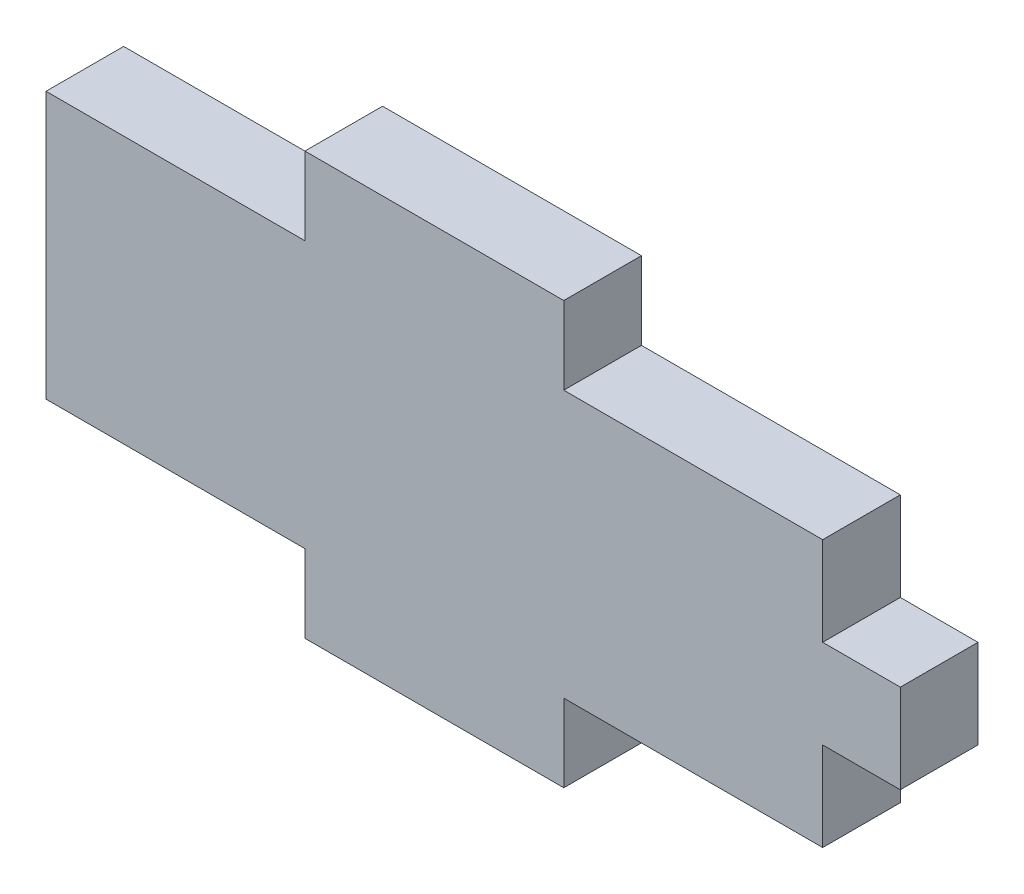
ISO-10303-21;
HEADER;
FILE_DESCRIPTION(('STEP AP214'),'2;1');
FILE_NAME('part.step','',(''),(''),'','','');
FILE_SCHEMA(('AUTOMOTIVE_DESIGN { 1 0 10303 214 1 1 1 1 }'));
ENDSEC;
DATA;
#1=APPLICATION_CONTEXT('core data for automotive mechanical design processes');
#2=APPLICATION_PROTOCOL_DEFINITION('international standard','automotive_design',2000,#1);
#3=PRODUCT_CONTEXT('',#1,'mechanical');
#4=PRODUCT('Part','Part','',(#3));
#5=PRODUCT_RELATED_PRODUCT_CATEGORY('part','',(#4));
#6=PRODUCT_DEFINITION_FORMATION('','',#4);
#7=PRODUCT_DEFINITION_CONTEXT('part definition',#1,'design');
#8=PRODUCT_DEFINITION('design','',#6,#7);
#9=PRODUCT_DEFINITION_SHAPE('','',#8);
#10=(LENGTH_UNIT() NAMED_UNIT(*) SI_UNIT(.MILLI.,.METRE.));
#11=(NAMED_UNIT(*) PLANE_ANGLE_UNIT() SI_UNIT($,.RADIAN.));
#12=(NAMED_UNIT(*) SI_UNIT($,.STERADIAN.) SOLID_ANGLE_UNIT());
#13=UNCERTAINTY_MEASURE_WITH_UNIT(LENGTH_MEASURE(1.E-05),#10,'distance_accuracy_value','');
#14=(GEOMETRIC_REPRESENTATION_CONTEXT(3) GLOBAL_UNCERTAINTY_ASSIGNED_CONTEXT((#13)) GLOBAL_UNIT_ASSIGNED_CONTEXT((#10,
#11,#12)) REPRESENTATION_CONTEXT('',''));
#15=CARTESIAN_POINT('',(0.,0.,0.));
#16=DIRECTION('',(0.,0.,1.));
#17=DIRECTION('',(1.,0.,0.));
#18=AXIS2_PLACEMENT_3D('',#15,#16,#17);
#19=CARTESIAN_POINT('',(0.,0.,3.));
#20=DIRECTION('',(1.,0.,0.));
#21=DIRECTION('',(0.,1.,0.));
#22=AXIS2_PLACEMENT_3D('',#19,#20,#21);
#23=PLANE('',#22);
#24=DIRECTION('',(0.,-1.,0.));
#25=VECTOR('',#24,1.);
#26=CARTESIAN_POINT('',(0.,0.,0.));
#27=LINE('',#26,#25);
#28=CARTESIAN_POINT('',(0.,10.3,0.));
#29=VERTEX_POINT('',#28);
#30=CARTESIAN_POINT('',(0.,0.,0.));
#31=VERTEX_POINT('',#30);
#32=EDGE_CURVE('E184',#29,#31,#27,.T.);
#33=ORIENTED_EDGE('',*,*,#32,.T.);
#34=DIRECTION('',(0.,0.,-1.));
#35=VECTOR('',#34,1.);
#36=CARTESIAN_POINT('',(0.,0.,3.));
#37=LINE('',#36,#35);
#38=CARTESIAN_POINT('',(0.,0.,3.));
#39=VERTEX_POINT('',#38);
#40=EDGE_CURVE('E11',#39,#31,#37,.T.);
#41=ORIENTED_EDGE('',*,*,#40,.F.);
#42=DIRECTION('',(0.,-1.,0.));
#43=VECTOR('',#42,1.);
#44=CARTESIAN_POINT('',(0.,0.,3.));
#45=LINE('',#44,#43);
#46=CARTESIAN_POINT('',(0.,10.3,3.));
#47=VERTEX_POINT('',#46);
#48=EDGE_CURVE('E214',#47,#39,#45,.T.);
#49=ORIENTED_EDGE('',*,*,#48,.F.);
#50=DIRECTION('',(0.,0.,-1.));
#51=VECTOR('',#50,1.);
#52=CARTESIAN_POINT('',(0.,10.3,3.));
#53=LINE('',#52,#51);
#54=EDGE_CURVE('E180',#47,#29,#53,.T.);
#55=ORIENTED_EDGE('',*,*,#54,.T.);
#56=EDGE_LOOP('',(#33,#41,#49,#55));
#57=FACE_BOUND('',#56,.T.);
#58=ADVANCED_FACE('F40',(#57),#23,.F.);
#59=CARTESIAN_POINT('',(0.,0.,3.));
#60=DIRECTION('',(0.,1.,0.));
#61=DIRECTION('',(0.,0.,1.));
#62=AXIS2_PLACEMENT_3D('',#59,#60,#61);
#63=PLANE('',#62);
#64=DIRECTION('',(1.,0.,0.));
#65=VECTOR('',#64,1.);
#66=CARTESIAN_POINT('',(0.,0.,0.));
#67=LINE('',#66,#65);
#68=CARTESIAN_POINT('',(10.,0.,0.));
#69=VERTEX_POINT('',#68);
#70=EDGE_CURVE('E187',#31,#69,#67,.T.);
#71=ORIENTED_EDGE('',*,*,#70,.T.);
#72=DIRECTION('',(0.,0.,-1.));
#73=VECTOR('',#72,1.);
#74=CARTESIAN_POINT('',(10.,0.,3.));
#75=LINE('',#74,#73);
#76=CARTESIAN_POINT('',(10.,0.,3.));
#77=VERTEX_POINT('',#76);
#78=EDGE_CURVE('E48',#77,#69,#75,.T.);
#79=ORIENTED_EDGE('',*,*,#78,.F.);
#80=DIRECTION('',(1.,0.,0.));
#81=VECTOR('',#80,1.);
#82=CARTESIAN_POINT('',(0.,0.,3.));
#83=LINE('',#82,#81);
#84=EDGE_CURVE('E123',#39,#77,#83,.T.);
#85=ORIENTED_EDGE('',*,*,#84,.F.);
#86=ORIENTED_EDGE('',*,*,#40,.T.);
#87=EDGE_LOOP('',(#71,#79,#85,#86));
#88=FACE_BOUND('',#87,.T.);
#89=ADVANCED_FACE('F312',(#88),#63,.F.);
#90=CARTESIAN_POINT('',(10.,0.,3.));
#91=DIRECTION('',(1.,0.,0.));
#92=DIRECTION('',(0.,1.,0.));
#93=AXIS2_PLACEMENT_3D('',#90,#91,#92);
#94=PLANE('',#93);
#95=DIRECTION('',(0.,-1.,0.));
#96=VECTOR('',#95,1.);
#97=CARTESIAN_POINT('',(10.,0.,0.));
#98=LINE('',#97,#96);
#99=CARTESIAN_POINT('',(10.,-3.,0.));
#100=VERTEX_POINT('',#99);
#101=EDGE_CURVE('E189',#69,#100,#98,.T.);
#102=ORIENTED_EDGE('',*,*,#101,.T.);
#103=DIRECTION('',(0.,0.,-1.));
#104=VECTOR('',#103,1.);
#105=CARTESIAN_POINT('',(10.,-3.,3.));
#106=LINE('',#105,#104);
#107=CARTESIAN_POINT('',(10.,-3.,3.));
#108=VERTEX_POINT('',#107);
#109=EDGE_CURVE('E245',#108,#100,#106,.T.);
#110=ORIENTED_EDGE('',*,*,#109,.F.);
#111=DIRECTION('',(0.,-1.,0.));
#112=VECTOR('',#111,1.);
#113=CARTESIAN_POINT('',(10.,0.,3.));
#114=LINE('',#113,#112);
#115=EDGE_CURVE('E253',#77,#108,#114,.T.);
#116=ORIENTED_EDGE('',*,*,#115,.F.);
#117=ORIENTED_EDGE('',*,*,#78,.T.);
#118=EDGE_LOOP('',(#102,#110,#116,#117));
#119=FACE_BOUND('',#118,.T.);
#120=ADVANCED_FACE('F251',(#119),#94,.F.);
#121=CARTESIAN_POINT('',(10.,-3.,3.));
#122=DIRECTION('',(0.,1.,0.));
#123=DIRECTION('',(0.,0.,1.));
#124=AXIS2_PLACEMENT_3D('',#121,#122,#123);
#125=PLANE('',#124);
#126=DIRECTION('',(1.,0.,0.));
#127=VECTOR('',#126,1.);
#128=CARTESIAN_POINT('',(10.,-3.,0.));
#129=LINE('',#128,#127);
#130=CARTESIAN_POINT('',(20.,-3.,0.));
#131=VERTEX_POINT('',#130);
#132=EDGE_CURVE('E191',#100,#131,#129,.T.);
#133=ORIENTED_EDGE('',*,*,#132,.T.);
#134=DIRECTION('',(0.,0.,-1.));
#135=VECTOR('',#134,1.);
#136=CARTESIAN_POINT('',(20.,-3.,3.));
#137=LINE('',#136,#135);
#138=CARTESIAN_POINT('',(20.,-3.,3.));
#139=VERTEX_POINT('',#138);
#140=EDGE_CURVE('E242',#139,#131,#137,.T.);
#141=ORIENTED_EDGE('',*,*,#140,.F.);
#142=DIRECTION('',(1.,0.,0.));
#143=VECTOR('',#142,1.);
#144=CARTESIAN_POINT('',(10.,-3.,3.));
#145=LINE('',#144,#143);
#146=EDGE_CURVE('E271',#108,#139,#145,.T.);
#147=ORIENTED_EDGE('',*,*,#146,.F.);
#148=ORIENTED_EDGE('',*,*,#109,.T.);
#149=EDGE_LOOP('',(#133,#141,#147,#148));
#150=FACE_BOUND('',#149,.T.);
#151=ADVANCED_FACE('F262',(#150),#125,.F.);
#152=CARTESIAN_POINT('',(20.,0.,3.));
#153=DIRECTION('',(-1.,0.,0.));
#154=DIRECTION('',(0.,0.,1.));
#155=AXIS2_PLACEMENT_3D('',#152,#153,#154);
#156=PLANE('',#155);
#157=DIRECTION('',(0.,1.,0.));
#158=VECTOR('',#157,1.);
#159=CARTESIAN_POINT('',(20.,0.,0.));
#160=LINE('',#159,#158);
#161=CARTESIAN_POINT('',(20.,0.,0.));
#162=VERTEX_POINT('',#161);
#163=EDGE_CURVE('E193',#131,#162,#160,.T.);
#164=ORIENTED_EDGE('',*,*,#163,.T.);
#165=DIRECTION('',(0.,0.,-1.));
#166=VECTOR('',#165,1.);
#167=CARTESIAN_POINT('',(20.,0.,3.));
#168=LINE('',#167,#166);
#169=CARTESIAN_POINT('',(20.,0.,3.));
#170=VERTEX_POINT('',#169);
#171=EDGE_CURVE('E239',#170,#162,#168,.T.);
#172=ORIENTED_EDGE('',*,*,#171,.F.);
#173=DIRECTION('',(0.,1.,0.));
#174=VECTOR('',#173,1.);
#175=CARTESIAN_POINT('',(20.,0.,3.));
#176=LINE('',#175,#174);
#177=EDGE_CURVE('E268',#139,#170,#176,.T.);
#178=ORIENTED_EDGE('',*,*,#177,.F.);
#179=ORIENTED_EDGE('',*,*,#140,.T.);
#180=EDGE_LOOP('',(#164,#172,#178,#179));
#181=FACE_BOUND('',#180,.T.);
#182=ADVANCED_FACE('F266',(#181),#156,.F.);
#183=CARTESIAN_POINT('',(20.,0.,3.));
#184=DIRECTION('',(0.,1.,0.));
#185=DIRECTION('',(0.,0.,1.));
#186=AXIS2_PLACEMENT_3D('',#183,#184,#185);
#187=PLANE('',#186);
#188=DIRECTION('',(1.,0.,0.));
#189=VECTOR('',#188,1.);
#190=CARTESIAN_POINT('',(20.,0.,0.));
#191=LINE('',#190,#189);
#192=CARTESIAN_POINT('',(30.,0.,0.));
#193=VERTEX_POINT('',#192);
#194=EDGE_CURVE('E195',#162,#193,#191,.T.);
#195=ORIENTED_EDGE('',*,*,#194,.T.);
#196=DIRECTION('',(0.,0.,-1.));
#197=VECTOR('',#196,1.);
#198=CARTESIAN_POINT('',(30.,0.,3.));
#199=LINE('',#198,#197);
#200=CARTESIAN_POINT('',(30.,0.,3.));
#201=VERTEX_POINT('',#200);
#202=EDGE_CURVE('E236',#201,#193,#199,.T.);
#203=ORIENTED_EDGE('',*,*,#202,.F.);
#204=DIRECTION('',(1.,0.,0.));
#205=VECTOR('',#204,1.);
#206=CARTESIAN_POINT('',(20.,0.,3.));
#207=LINE('',#206,#205);
#208=EDGE_CURVE('E270',#170,#201,#207,.T.);
#209=ORIENTED_EDGE('',*,*,#208,.F.);
#210=ORIENTED_EDGE('',*,*,#171,.T.);
#211=EDGE_LOOP('',(#195,#203,#209,#210));
#212=FACE_BOUND('',#211,.T.);
#213=ADVANCED_FACE('F325',(#212),#187,.F.);
#214=CARTESIAN_POINT('',(30.,0.,3.));
#215=DIRECTION('',(-1.,0.,0.));
#216=DIRECTION('',(0.,-1.,0.));
#217=AXIS2_PLACEMENT_3D('',#214,#215,#216);
#218=PLANE('',#217);
#219=DIRECTION('',(0.,1.,0.));
#220=VECTOR('',#219,1.);
#221=CARTESIAN_POINT('',(30.,0.,0.));
#222=LINE('',#221,#220);
#223=CARTESIAN_POINT('',(30.,3.43333333666667,0.));
#224=VERTEX_POINT('',#223);
#225=EDGE_CURVE('E197',#193,#224,#222,.T.);
#226=ORIENTED_EDGE('',*,*,#225,.T.);
#227=DIRECTION('',(0.,0.,-1.));
#228=VECTOR('',#227,1.);
#229=CARTESIAN_POINT('',(30.,3.43333333666667,3.));
#230=LINE('',#229,#228);
#231=CARTESIAN_POINT('',(30.,3.43333333666667,3.));
#232=VERTEX_POINT('',#231);
#233=EDGE_CURVE('E233',#232,#224,#230,.T.);
#234=ORIENTED_EDGE('',*,*,#233,.F.);
#235=DIRECTION('',(0.,1.,0.));
#236=VECTOR('',#235,1.);
#237=CARTESIAN_POINT('',(30.,0.,3.));
#238=LINE('',#237,#236);
#239=EDGE_CURVE('E273',#201,#232,#238,.T.);
#240=ORIENTED_EDGE('',*,*,#239,.F.);
#241=ORIENTED_EDGE('',*,*,#202,.T.);
#242=EDGE_LOOP('',(#226,#234,#240,#241));
#243=FACE_BOUND('',#242,.T.);
#244=ADVANCED_FACE('F328',(#243),#218,.F.);
#245=CARTESIAN_POINT('',(30.,3.43333333666667,3.));
#246=DIRECTION('',(0.,1.,0.));
#247=DIRECTION('',(0.,0.,1.));
#248=AXIS2_PLACEMENT_3D('',#245,#246,#247);
#249=PLANE('',#248);
#250=DIRECTION('',(1.,0.,0.));
#251=VECTOR('',#250,1.);
#252=CARTESIAN_POINT('',(30.,3.43333333666667,0.));
#253=LINE('',#252,#251);
#254=CARTESIAN_POINT('',(33.,3.43333333666667,0.));
#255=VERTEX_POINT('',#254);
#256=EDGE_CURVE('E199',#224,#255,#253,.T.);
#257=ORIENTED_EDGE('',*,*,#256,.T.);
#258=DIRECTION('',(0.,0.,-1.));
#259=VECTOR('',#258,1.);
#260=CARTESIAN_POINT('',(33.,3.43333333666667,3.));
#261=LINE('',#260,#259);
#262=CARTESIAN_POINT('',(33.,3.43333333666667,3.));
#263=VERTEX_POINT('',#262);
#264=EDGE_CURVE('E230',#263,#255,#261,.T.);
#265=ORIENTED_EDGE('',*,*,#264,.F.);
#266=DIRECTION('',(1.,0.,0.));
#267=VECTOR('',#266,1.);
#268=CARTESIAN_POINT('',(30.,3.43333333666667,3.));
#269=LINE('',#268,#267);
#270=EDGE_CURVE('E279',#232,#263,#269,.T.);
#271=ORIENTED_EDGE('',*,*,#270,.F.);
#272=ORIENTED_EDGE('',*,*,#233,.T.);
#273=EDGE_LOOP('',(#257,#265,#271,#272));
#274=FACE_BOUND('',#273,.T.);
#275=ADVANCED_FACE('F332',(#274),#249,.F.);
#276=CARTESIAN_POINT('',(33.,6.86666666666667,3.));
#277=DIRECTION('',(-1.,0.,0.));
#278=DIRECTION('',(0.,0.,1.));
#279=AXIS2_PLACEMENT_3D('',#276,#277,#278);
#280=PLANE('',#279);
#281=DIRECTION('',(0.,1.,0.));
#282=VECTOR('',#281,1.);
#283=CARTESIAN_POINT('',(33.,6.86666666666667,0.));
#284=LINE('',#283,#282);
#285=CARTESIAN_POINT('',(33.,6.86666666666667,0.));
#286=VERTEX_POINT('',#285);
#287=EDGE_CURVE('E201',#255,#286,#284,.T.);
#288=ORIENTED_EDGE('',*,*,#287,.T.);
#289=DIRECTION('',(0.,0.,-1.));
#290=VECTOR('',#289,1.);
#291=CARTESIAN_POINT('',(33.,6.86666666666667,3.));
#292=LINE('',#291,#290);
#293=CARTESIAN_POINT('',(33.,6.86666666666667,3.));
#294=VERTEX_POINT('',#293);
#295=EDGE_CURVE('E227',#294,#286,#292,.T.);
#296=ORIENTED_EDGE('',*,*,#295,.F.);
#297=DIRECTION('',(0.,1.,0.));
#298=VECTOR('',#297,1.);
#299=CARTESIAN_POINT('',(33.,6.86666666666667,3.));
#300=LINE('',#299,#298);
#301=EDGE_CURVE('E281',#263,#294,#300,.T.);
#302=ORIENTED_EDGE('',*,*,#301,.F.);
#303=ORIENTED_EDGE('',*,*,#264,.T.);
#304=EDGE_LOOP('',(#288,#296,#302,#303));
#305=FACE_BOUND('',#304,.T.);
#306=ADVANCED_FACE('F336',(#305),#280,.F.);
#307=CARTESIAN_POINT('',(30.,6.86666666666667,3.));
#308=DIRECTION('',(0.,-1.,0.));
#309=DIRECTION('',(0.,0.,-1.));
#310=AXIS2_PLACEMENT_3D('',#307,#308,#309);
#311=PLANE('',#310);
#312=DIRECTION('',(-1.,0.,0.));
#313=VECTOR('',#312,1.);
#314=CARTESIAN_POINT('',(30.,6.86666666666667,0.));
#315=LINE('',#314,#313);
#316=CARTESIAN_POINT('',(30.,6.86666666666667,0.));
#317=VERTEX_POINT('',#316);
#318=EDGE_CURVE('E203',#286,#317,#315,.T.);
#319=ORIENTED_EDGE('',*,*,#318,.T.);
#320=DIRECTION('',(0.,0.,-1.));
#321=VECTOR('',#320,1.);
#322=CARTESIAN_POINT('',(30.,6.86666666666667,3.));
#323=LINE('',#322,#321);
#324=CARTESIAN_POINT('',(30.,6.86666666666667,3.));
#325=VERTEX_POINT('',#324);
#326=EDGE_CURVE('E224',#325,#317,#323,.T.);
#327=ORIENTED_EDGE('',*,*,#326,.F.);
#328=DIRECTION('',(-1.,0.,0.));
#329=VECTOR('',#328,1.);
#330=CARTESIAN_POINT('',(30.,6.86666666666667,3.));
#331=LINE('',#330,#329);
#332=EDGE_CURVE('E283',#294,#325,#331,.T.);
#333=ORIENTED_EDGE('',*,*,#332,.F.);
#334=ORIENTED_EDGE('',*,*,#295,.T.);
#335=EDGE_LOOP('',(#319,#327,#333,#334));
#336=FACE_BOUND('',#335,.T.);
#337=ADVANCED_FACE('F340',(#336),#311,.F.);
#338=CARTESIAN_POINT('',(30.,6.86666666666667,3.));
#339=DIRECTION('',(-1.,0.,0.));
#340=DIRECTION('',(0.,0.,1.));
#341=AXIS2_PLACEMENT_3D('',#338,#339,#340);
#342=PLANE('',#341);
#343=DIRECTION('',(0.,1.,0.));
#344=VECTOR('',#343,1.);
#345=CARTESIAN_POINT('',(30.,6.86666666666667,0.));
#346=LINE('',#345,#344);
#347=CARTESIAN_POINT('',(30.,10.3,0.));
#348=VERTEX_POINT('',#347);
#349=EDGE_CURVE('E205',#317,#348,#346,.T.);
#350=ORIENTED_EDGE('',*,*,#349,.T.);
#351=DIRECTION('',(0.,0.,-1.));
#352=VECTOR('',#351,1.);
#353=CARTESIAN_POINT('',(30.,10.3,3.));
#354=LINE('',#353,#352);
#355=CARTESIAN_POINT('',(30.,10.3,3.));
#356=VERTEX_POINT('',#355);
#357=EDGE_CURVE('E221',#356,#348,#354,.T.);
#358=ORIENTED_EDGE('',*,*,#357,.F.);
#359=DIRECTION('',(0.,1.,0.));
#360=VECTOR('',#359,1.);
#361=CARTESIAN_POINT('',(30.,6.86666666666667,3.));
#362=LINE('',#361,#360);
#363=EDGE_CURVE('E285',#325,#356,#362,.T.);
#364=ORIENTED_EDGE('',*,*,#363,.F.);
#365=ORIENTED_EDGE('',*,*,#326,.T.);
#366=EDGE_LOOP('',(#350,#358,#364,#365));
#367=FACE_BOUND('',#366,.T.);
#368=ADVANCED_FACE('F344',(#367),#342,.F.);
#369=CARTESIAN_POINT('',(20.,10.3,3.));
#370=DIRECTION('',(0.,-1.,0.));
#371=DIRECTION('',(1.,0.,0.));
#372=AXIS2_PLACEMENT_3D('',#369,#370,#371);
#373=PLANE('',#372);
#374=DIRECTION('',(-1.,0.,0.));
#375=VECTOR('',#374,1.);
#376=CARTESIAN_POINT('',(20.,10.3,0.));
#377=LINE('',#376,#375);
#378=CARTESIAN_POINT('',(20.,10.3,0.));
#379=VERTEX_POINT('',#378);
#380=EDGE_CURVE('E207',#348,#379,#377,.T.);
#381=ORIENTED_EDGE('',*,*,#380,.T.);
#382=DIRECTION('',(0.,0.,-1.));
#383=VECTOR('',#382,1.);
#384=CARTESIAN_POINT('',(20.,10.3,3.));
#385=LINE('',#384,#383);
#386=CARTESIAN_POINT('',(20.,10.3,3.));
#387=VERTEX_POINT('',#386);
#388=EDGE_CURVE('E218',#387,#379,#385,.T.);
#389=ORIENTED_EDGE('',*,*,#388,.F.);
#390=DIRECTION('',(-1.,0.,0.));
#391=VECTOR('',#390,1.);
#392=CARTESIAN_POINT('',(20.,10.3,3.));
#393=LINE('',#392,#391);
#394=EDGE_CURVE('E287',#356,#387,#393,.T.);
#395=ORIENTED_EDGE('',*,*,#394,.F.);
#396=ORIENTED_EDGE('',*,*,#357,.T.);
#397=EDGE_LOOP('',(#381,#389,#395,#396));
#398=FACE_BOUND('',#397,.T.);
#399=ADVANCED_FACE('F293',(#398),#373,.F.);
#400=CARTESIAN_POINT('',(20.,10.3,3.));
#401=DIRECTION('',(-1.,0.,0.));
#402=DIRECTION('',(0.,0.,1.));
#403=AXIS2_PLACEMENT_3D('',#400,#401,#402);
#404=PLANE('',#403);
#405=DIRECTION('',(0.,1.,0.));
#406=VECTOR('',#405,1.);
#407=CARTESIAN_POINT('',(20.,10.3,0.));
#408=LINE('',#407,#406);
#409=CARTESIAN_POINT('',(20.,13.3,0.));
#410=VERTEX_POINT('',#409);
#411=EDGE_CURVE('E209',#379,#410,#408,.T.);
#412=ORIENTED_EDGE('',*,*,#411,.T.);
#413=DIRECTION('',(0.,0.,-1.));
#414=VECTOR('',#413,1.);
#415=CARTESIAN_POINT('',(20.,13.3,3.));
#416=LINE('',#415,#414);
#417=CARTESIAN_POINT('',(20.,13.3,3.));
#418=VERTEX_POINT('',#417);
#419=EDGE_CURVE('E175',#418,#410,#416,.T.);
#420=ORIENTED_EDGE('',*,*,#419,.F.);
#421=DIRECTION('',(0.,1.,0.));
#422=VECTOR('',#421,1.);
#423=CARTESIAN_POINT('',(20.,10.3,3.));
#424=LINE('',#423,#422);
#425=EDGE_CURVE('E166',#387,#418,#424,.T.);
#426=ORIENTED_EDGE('',*,*,#425,.F.);
#427=ORIENTED_EDGE('',*,*,#388,.T.);
#428=EDGE_LOOP('',(#412,#420,#426,#427));
#429=FACE_BOUND('',#428,.T.);
#430=ADVANCED_FACE('F297',(#429),#404,.F.);
#431=CARTESIAN_POINT('',(10.,13.3,3.));
#432=DIRECTION('',(0.,-1.,0.));
#433=DIRECTION('',(0.,0.,-1.));
#434=AXIS2_PLACEMENT_3D('',#431,#432,#433);
#435=PLANE('',#434);
#436=DIRECTION('',(-1.,0.,0.));
#437=VECTOR('',#436,1.);
#438=CARTESIAN_POINT('',(10.,13.3,0.));
#439=LINE('',#438,#437);
#440=CARTESIAN_POINT('',(10.,13.3,0.));
#441=VERTEX_POINT('',#440);
#442=EDGE_CURVE('E174',#410,#441,#439,.T.);
#443=ORIENTED_EDGE('',*,*,#442,.T.);
#444=DIRECTION('',(0.,0.,-1.));
#445=VECTOR('',#444,1.);
#446=CARTESIAN_POINT('',(10.,13.3,3.));
#447=LINE('',#446,#445);
#448=CARTESIAN_POINT('',(10.,13.3,3.));
#449=VERTEX_POINT('',#448);
#450=EDGE_CURVE('E171',#449,#441,#447,.T.);
#451=ORIENTED_EDGE('',*,*,#450,.F.);
#452=DIRECTION('',(-1.,0.,0.));
#453=VECTOR('',#452,1.);
#454=CARTESIAN_POINT('',(10.,13.3,3.));
#455=LINE('',#454,#453);
#456=EDGE_CURVE('E160',#418,#449,#455,.T.);
#457=ORIENTED_EDGE('',*,*,#456,.F.);
#458=ORIENTED_EDGE('',*,*,#419,.T.);
#459=EDGE_LOOP('',(#443,#451,#457,#458));
#460=FACE_BOUND('',#459,.T.);
#461=ADVANCED_FACE('F172',(#460),#435,.F.);
#462=CARTESIAN_POINT('',(10.,10.3,3.));
#463=DIRECTION('',(1.,0.,0.));
#464=DIRECTION('',(0.,1.,0.));
#465=AXIS2_PLACEMENT_3D('',#462,#463,#464);
#466=PLANE('',#465);
#467=DIRECTION('',(0.,-1.,0.));
#468=VECTOR('',#467,1.);
#469=CARTESIAN_POINT('',(10.,10.3,0.));
#470=LINE('',#469,#468);
#471=CARTESIAN_POINT('',(10.,10.3,0.));
#472=VERTEX_POINT('',#471);
#473=EDGE_CURVE('E109',#441,#472,#470,.T.);
#474=ORIENTED_EDGE('',*,*,#473,.T.);
#475=DIRECTION('',(0.,0.,-1.));
#476=VECTOR('',#475,1.);
#477=CARTESIAN_POINT('',(10.,10.3,3.));
#478=LINE('',#477,#476);
#479=CARTESIAN_POINT('',(10.,10.3,3.));
#480=VERTEX_POINT('',#479);
#481=EDGE_CURVE('E176',#480,#472,#478,.T.);
#482=ORIENTED_EDGE('',*,*,#481,.F.);
#483=DIRECTION('',(0.,-1.,0.));
#484=VECTOR('',#483,1.);
#485=CARTESIAN_POINT('',(10.,10.3,3.));
#486=LINE('',#485,#484);
#487=EDGE_CURVE('E164',#449,#480,#486,.T.);
#488=ORIENTED_EDGE('',*,*,#487,.F.);
#489=ORIENTED_EDGE('',*,*,#450,.T.);
#490=EDGE_LOOP('',(#474,#482,#488,#489));
#491=FACE_BOUND('',#490,.T.);
#492=ADVANCED_FACE('F178',(#491),#466,.F.);
#493=CARTESIAN_POINT('',(0.,10.3,3.));
#494=DIRECTION('',(0.,-1.,0.));
#495=DIRECTION('',(1.,0.,0.));
#496=AXIS2_PLACEMENT_3D('',#493,#494,#495);
#497=PLANE('',#496);
#498=DIRECTION('',(-1.,0.,0.));
#499=VECTOR('',#498,1.);
#500=CARTESIAN_POINT('',(0.,10.3,0.));
#501=LINE('',#500,#499);
#502=EDGE_CURVE('E115',#472,#29,#501,.T.);
#503=ORIENTED_EDGE('',*,*,#502,.T.);
#504=ORIENTED_EDGE('',*,*,#54,.F.);
#505=DIRECTION('',(-1.,0.,0.));
#506=VECTOR('',#505,1.);
#507=CARTESIAN_POINT('',(0.,10.3,3.));
#508=LINE('',#507,#506);
#509=EDGE_CURVE('E56',#480,#47,#508,.T.);
#510=ORIENTED_EDGE('',*,*,#509,.F.);
#511=ORIENTED_EDGE('',*,*,#481,.T.);
#512=EDGE_LOOP('',(#503,#504,#510,#511));
#513=FACE_BOUND('',#512,.T.);
#514=ADVANCED_FACE('F301',(#513),#497,.F.);
#515=CARTESIAN_POINT('',(0.,0.,3.));
#516=DIRECTION('',(0.,0.,-1.));
#517=DIRECTION('',(-1.,0.,0.));
#518=AXIS2_PLACEMENT_3D('',#515,#516,#517);
#519=PLANE('',#518);
#520=ORIENTED_EDGE('',*,*,#48,.T.);
#521=ORIENTED_EDGE('',*,*,#84,.T.);
#522=ORIENTED_EDGE('',*,*,#115,.T.);
#523=ORIENTED_EDGE('',*,*,#146,.T.);
#524=ORIENTED_EDGE('',*,*,#177,.T.);
#525=ORIENTED_EDGE('',*,*,#208,.T.);
#526=ORIENTED_EDGE('',*,*,#239,.T.);
#527=ORIENTED_EDGE('',*,*,#270,.T.);
#528=ORIENTED_EDGE('',*,*,#301,.T.);
#529=ORIENTED_EDGE('',*,*,#332,.T.);
#530=ORIENTED_EDGE('',*,*,#363,.T.);
#531=ORIENTED_EDGE('',*,*,#394,.T.);
#532=ORIENTED_EDGE('',*,*,#425,.T.);
#533=ORIENTED_EDGE('',*,*,#456,.T.);
#534=ORIENTED_EDGE('',*,*,#487,.T.);
#535=ORIENTED_EDGE('',*,*,#509,.T.);
#536=EDGE_LOOP('',(#520,#521,#522,#523,#524,#525,#526,#527,#528,#529,#530,#531,#532,#533,#534,#535));
#537=FACE_BOUND('',#536,.T.);
#538=ADVANCED_FACE('F162',(#537),#519,.F.);
#539=CARTESIAN_POINT('',(0.,0.,0.));
#540=DIRECTION('',(0.,0.,-1.));
#541=DIRECTION('',(-1.,0.,0.));
#542=AXIS2_PLACEMENT_3D('',#539,#540,#541);
#543=PLANE('',#542);
#544=ORIENTED_EDGE('',*,*,#32,.F.);
#545=ORIENTED_EDGE('',*,*,#502,.F.);
#546=ORIENTED_EDGE('',*,*,#473,.F.);
#547=ORIENTED_EDGE('',*,*,#442,.F.);
#548=ORIENTED_EDGE('',*,*,#411,.F.);
#549=ORIENTED_EDGE('',*,*,#380,.F.);
#550=ORIENTED_EDGE('',*,*,#349,.F.);
#551=ORIENTED_EDGE('',*,*,#318,.F.);
#552=ORIENTED_EDGE('',*,*,#287,.F.);
#553=ORIENTED_EDGE('',*,*,#256,.F.);
#554=ORIENTED_EDGE('',*,*,#225,.F.);
#555=ORIENTED_EDGE('',*,*,#194,.F.);
#556=ORIENTED_EDGE('',*,*,#163,.F.);
#557=ORIENTED_EDGE('',*,*,#132,.F.);
#558=ORIENTED_EDGE('',*,*,#101,.F.);
#559=ORIENTED_EDGE('',*,*,#70,.F.);
#560=EDGE_LOOP('',(#544,#545,#546,#547,#548,#549,#550,#551,#552,#553,#554,#555,#556,#557,#558,#559));
#561=FACE_BOUND('',#560,.T.);
#562=ADVANCED_FACE('F257',(#561),#543,.T.);
#563=CLOSED_SHELL('',(#58,#89,#120,#151,#182,#213,#244,#275,#306,#337,#368,#399,#430,#461,#492,
#514,#538,#562));
#564=MANIFOLD_SOLID_BREP('B2',#563);
#565=ADVANCED_BREP_SHAPE_REPRESENTATION('',(#18,#564),#14);
#566=SHAPE_DEFINITION_REPRESENTATION(#9,#565);
ENDSEC;
END-ISO-10303-21;
